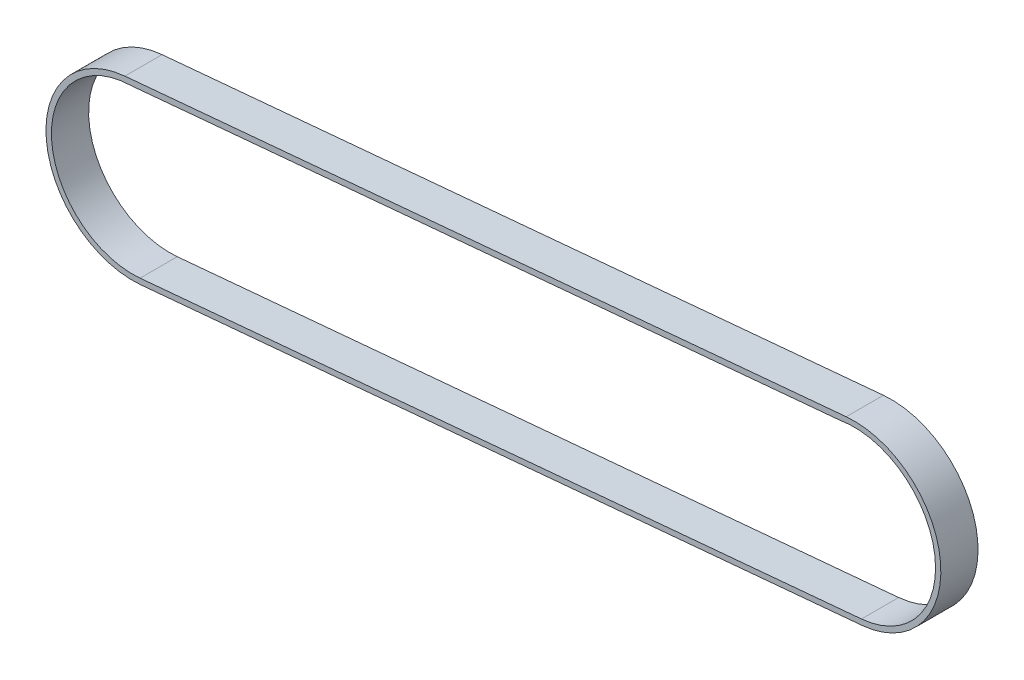
ISO-10303-21;
HEADER;
FILE_DESCRIPTION(('STEP AP214'),'2;1');
FILE_NAME('part.step','',(''),(''),'','','');
FILE_SCHEMA(('AUTOMOTIVE_DESIGN { 1 0 10303 214 1 1 1 1 }'));
ENDSEC;
DATA;
#1=APPLICATION_CONTEXT('core data for automotive mechanical design processes');
#2=APPLICATION_PROTOCOL_DEFINITION('international standard','automotive_design',2000,#1);
#3=PRODUCT_CONTEXT('',#1,'mechanical');
#4=PRODUCT('Part','Part','',(#3));
#5=PRODUCT_RELATED_PRODUCT_CATEGORY('part','',(#4));
#6=PRODUCT_DEFINITION_FORMATION('','',#4);
#7=PRODUCT_DEFINITION_CONTEXT('part definition',#1,'design');
#8=PRODUCT_DEFINITION('design','',#6,#7);
#9=PRODUCT_DEFINITION_SHAPE('','',#8);
#10=(LENGTH_UNIT() NAMED_UNIT(*) SI_UNIT(.MILLI.,.METRE.));
#11=(NAMED_UNIT(*) PLANE_ANGLE_UNIT() SI_UNIT($,.RADIAN.));
#12=(NAMED_UNIT(*) SI_UNIT($,.STERADIAN.) SOLID_ANGLE_UNIT());
#13=UNCERTAINTY_MEASURE_WITH_UNIT(LENGTH_MEASURE(1.E-05),#10,'distance_accuracy_value','');
#14=(GEOMETRIC_REPRESENTATION_CONTEXT(3) GLOBAL_UNCERTAINTY_ASSIGNED_CONTEXT((#13)) GLOBAL_UNIT_ASSIGNED_CONTEXT((#10,
#11,#12)) REPRESENTATION_CONTEXT('',''));
#15=CARTESIAN_POINT('',(0.,0.,0.));
#16=DIRECTION('',(0.,0.,1.));
#17=DIRECTION('',(1.,0.,0.));
#18=AXIS2_PLACEMENT_3D('',#15,#16,#17);
#19=CARTESIAN_POINT('',(-8.44642834172912,92.7513451865349,7.5));
#20=DIRECTION('',(0.0906900274029644,-0.995879168840101,0.));
#21=DIRECTION('',(0.995879168840101,0.0906900274029644,0.));
#22=AXIS2_PLACEMENT_3D('',#19,#20,#21);
#23=PLANE('',#22);
#24=DIRECTION('',(-0.995879168840101,-0.0906900274029644,0.));
#25=VECTOR('',#24,1.);
#26=CARTESIAN_POINT('',(-8.44642834172912,92.7513451865349,-7.5));
#27=LINE('',#26,#25);
#28=CARTESIAN_POINT('',(212.322925822602,112.855770909404,-7.5));
#29=VERTEX_POINT('',#28);
#30=CARTESIAN_POINT('',(-78.6770741773979,86.3557709094036,-7.5));
#31=VERTEX_POINT('',#30);
#32=EDGE_CURVE('E148',#29,#31,#27,.T.);
#33=ORIENTED_EDGE('',*,*,#32,.T.);
#34=DIRECTION('',(0.,0.,-1.));
#35=VECTOR('',#34,1.);
#36=CARTESIAN_POINT('',(-78.6770741773979,86.3557709094036,7.5));
#37=LINE('',#36,#35);
#38=CARTESIAN_POINT('',(-78.6770741773979,86.3557709094036,7.5));
#39=VERTEX_POINT('',#38);
#40=EDGE_CURVE('E11',#39,#31,#37,.T.);
#41=ORIENTED_EDGE('',*,*,#40,.F.);
#42=DIRECTION('',(-0.995879168840101,-0.0906900274029644,0.));
#43=VECTOR('',#42,1.);
#44=CARTESIAN_POINT('',(-8.44642834172912,92.7513451865349,7.5));
#45=LINE('',#44,#43);
#46=CARTESIAN_POINT('',(212.322925822602,112.855770909404,7.5));
#47=VERTEX_POINT('',#46);
#48=EDGE_CURVE('E119',#47,#39,#45,.T.);
#49=ORIENTED_EDGE('',*,*,#48,.F.);
#50=DIRECTION('',(0.,0.,-1.));
#51=VECTOR('',#50,1.);
#52=CARTESIAN_POINT('',(212.322925822602,112.855770909404,7.5));
#53=LINE('',#52,#51);
#54=EDGE_CURVE('E156',#47,#29,#53,.T.);
#55=ORIENTED_EDGE('',*,*,#54,.T.);
#56=EDGE_LOOP('',(#33,#41,#49,#55));
#57=FACE_BOUND('',#56,.T.);
#58=ADVANCED_FACE('F42',(#57),#23,.F.);
#59=CARTESIAN_POINT('',(-75.5029232182942,51.5,7.5));
#60=DIRECTION('',(0.,0.,-1.));
#61=DIRECTION('',(-1.,0.,0.));
#62=AXIS2_PLACEMENT_3D('',#59,#60,#61);
#63=CYLINDRICAL_SURFACE('',#62,35.);
#64=CARTESIAN_POINT('',(-75.5029232182942,51.5,-7.5));
#65=DIRECTION('',(0.,0.,1.));
#66=DIRECTION('',(1.,0.,0.));
#67=AXIS2_PLACEMENT_3D('',#64,#65,#66);
#68=CIRCLE('',#67,35.);
#69=CARTESIAN_POINT('',(-72.3287722591905,16.6442290905965,-7.5));
#70=VERTEX_POINT('',#69);
#71=EDGE_CURVE('E125',#31,#70,#68,.T.);
#72=ORIENTED_EDGE('',*,*,#71,.T.);
#73=DIRECTION('',(0.,0.,-1.));
#74=VECTOR('',#73,1.);
#75=CARTESIAN_POINT('',(-72.3287722591905,16.6442290905965,7.5));
#76=LINE('',#75,#74);
#77=CARTESIAN_POINT('',(-72.3287722591905,16.6442290905965,7.5));
#78=VERTEX_POINT('',#77);
#79=EDGE_CURVE('E52',#78,#70,#76,.T.);
#80=ORIENTED_EDGE('',*,*,#79,.F.);
#81=CARTESIAN_POINT('',(-75.5029232182942,51.5,7.5));
#82=DIRECTION('',(0.,0.,1.));
#83=DIRECTION('',(1.,0.,0.));
#84=AXIS2_PLACEMENT_3D('',#81,#82,#83);
#85=CIRCLE('',#84,35.);
#86=EDGE_CURVE('E113',#39,#78,#85,.T.);
#87=ORIENTED_EDGE('',*,*,#86,.F.);
#88=ORIENTED_EDGE('',*,*,#40,.T.);
#89=EDGE_LOOP('',(#72,#80,#87,#88));
#90=FACE_BOUND('',#89,.T.);
#91=ADVANCED_FACE('F124',(#90),#63,.T.);
#92=CARTESIAN_POINT('',(-2.0981264235216,23.0398033677279,7.5));
#93=DIRECTION('',(0.0906900274029643,-0.995879168840101,0.));
#94=DIRECTION('',(0.995879168840101,0.0906900274029643,0.));
#95=AXIS2_PLACEMENT_3D('',#92,#93,#94);
#96=PLANE('',#95);
#97=DIRECTION('',(-0.995879168840101,-0.0906900274029643,0.));
#98=VECTOR('',#97,1.);
#99=CARTESIAN_POINT('',(-2.0981264235216,23.0398033677279,-7.5));
#100=LINE('',#99,#98);
#101=CARTESIAN_POINT('',(218.67122774081,43.1442290905965,-7.5));
#102=VERTEX_POINT('',#101);
#103=EDGE_CURVE('E152',#102,#70,#100,.T.);
#104=ORIENTED_EDGE('',*,*,#103,.F.);
#105=DIRECTION('',(0.,0.,-1.));
#106=VECTOR('',#105,1.);
#107=CARTESIAN_POINT('',(218.67122774081,43.1442290905965,7.5));
#108=LINE('',#107,#106);
#109=CARTESIAN_POINT('',(218.67122774081,43.1442290905965,7.5));
#110=VERTEX_POINT('',#109);
#111=EDGE_CURVE('E89',#110,#102,#108,.T.);
#112=ORIENTED_EDGE('',*,*,#111,.F.);
#113=DIRECTION('',(-0.995879168840101,-0.0906900274029643,0.));
#114=VECTOR('',#113,1.);
#115=CARTESIAN_POINT('',(-2.0981264235216,23.0398033677279,7.5));
#116=LINE('',#115,#114);
#117=EDGE_CURVE('E117',#110,#78,#116,.T.);
#118=ORIENTED_EDGE('',*,*,#117,.T.);
#119=ORIENTED_EDGE('',*,*,#79,.T.);
#120=EDGE_LOOP('',(#104,#112,#118,#119));
#121=FACE_BOUND('',#120,.T.);
#122=ADVANCED_FACE('F130',(#121),#96,.T.);
#123=CARTESIAN_POINT('',(-75.5029232182942,51.5,7.5));
#124=DIRECTION('',(0.,0.,-1.));
#125=DIRECTION('',(-1.,0.,0.));
#126=AXIS2_PLACEMENT_3D('',#123,#124,#125);
#127=CYLINDRICAL_SURFACE('',#126,32.7983025223947);
#128=CARTESIAN_POINT('',(-75.5029232182942,51.5,-7.5));
#129=DIRECTION('',(0.,0.,1.));
#130=DIRECTION('',(1.,0.,0.));
#131=AXIS2_PLACEMENT_3D('',#128,#129,#130);
#132=CIRCLE('',#131,32.7983025223947);
#133=CARTESIAN_POINT('',(-76.1680678689313,84.2915573119706,-7.5));
#134=VERTEX_POINT('',#133);
#135=CARTESIAN_POINT('',(-72.535281972323,18.8362317883296,-7.5));
#136=VERTEX_POINT('',#135);
#137=EDGE_CURVE('E136',#134,#136,#132,.T.);
#138=ORIENTED_EDGE('',*,*,#137,.F.);
#139=DIRECTION('',(0.,0.,-1.));
#140=VECTOR('',#139,1.);
#141=CARTESIAN_POINT('',(-76.1680678689313,84.2915573119706,7.5));
#142=LINE('',#141,#140);
#143=CARTESIAN_POINT('',(-76.1680678689313,84.2915573119706,7.5));
#144=VERTEX_POINT('',#143);
#145=EDGE_CURVE('E46',#144,#134,#142,.T.);
#146=ORIENTED_EDGE('',*,*,#145,.F.);
#147=CARTESIAN_POINT('',(-75.5029232182942,51.5,7.5));
#148=DIRECTION('',(0.,0.,1.));
#149=DIRECTION('',(1.,0.,0.));
#150=AXIS2_PLACEMENT_3D('',#147,#148,#149);
#151=CIRCLE('',#150,32.7983025223947);
#152=CARTESIAN_POINT('',(-72.535281972323,18.8362317883296,7.5));
#153=VERTEX_POINT('',#152);
#154=EDGE_CURVE('E155',#144,#153,#151,.T.);
#155=ORIENTED_EDGE('',*,*,#154,.T.);
#156=DIRECTION('',(0.,0.,-1.));
#157=VECTOR('',#156,1.);
#158=CARTESIAN_POINT('',(-72.535281972323,18.8362317883296,7.5));
#159=LINE('',#158,#157);
#160=EDGE_CURVE('E132',#153,#136,#159,.T.);
#161=ORIENTED_EDGE('',*,*,#160,.T.);
#162=EDGE_LOOP('',(#138,#146,#155,#161));
#163=FACE_BOUND('',#162,.T.);
#164=ADVANCED_FACE('F44',(#163),#127,.F.);
#165=CARTESIAN_POINT('',(-8.24917168390729,90.4835619495026,7.5));
#166=DIRECTION('',(0.0907911016346949,-0.995869959313945,0.));
#167=DIRECTION('',(0.995869959313945,0.0907911016346949,0.));
#168=AXIS2_PLACEMENT_3D('',#165,#166,#167);
#169=PLANE('',#168);
#170=DIRECTION('',(-0.995869959313945,-0.0907911016346949,0.));
#171=VECTOR('',#170,1.);
#172=CARTESIAN_POINT('',(-8.24917168390729,90.4835619495026,-7.5));
#173=LINE('',#172,#171);
#174=CARTESIAN_POINT('',(209.808909500006,110.363399900106,-7.5));
#175=VERTEX_POINT('',#174);
#176=EDGE_CURVE('E139',#175,#134,#173,.T.);
#177=ORIENTED_EDGE('',*,*,#176,.F.);
#178=DIRECTION('',(0.,0.,-1.));
#179=VECTOR('',#178,1.);
#180=CARTESIAN_POINT('',(209.808909500006,110.363399900106,7.5));
#181=LINE('',#180,#179);
#182=CARTESIAN_POINT('',(209.808909500006,110.363399900106,7.5));
#183=VERTEX_POINT('',#182);
#184=EDGE_CURVE('E161',#183,#175,#181,.T.);
#185=ORIENTED_EDGE('',*,*,#184,.F.);
#186=DIRECTION('',(-0.995869959313945,-0.0907911016346949,0.));
#187=VECTOR('',#186,1.);
#188=CARTESIAN_POINT('',(-8.24917168390729,90.4835619495026,7.5));
#189=LINE('',#188,#187);
#190=EDGE_CURVE('E170',#183,#144,#189,.T.);
#191=ORIENTED_EDGE('',*,*,#190,.T.);
#192=ORIENTED_EDGE('',*,*,#145,.T.);
#193=EDGE_LOOP('',(#177,#185,#191,#192));
#194=FACE_BOUND('',#193,.T.);
#195=ADVANCED_FACE('F168',(#194),#169,.T.);
#196=CARTESIAN_POINT('',(215.497076781706,78.,7.5));
#197=DIRECTION('',(0.,0.,-1.));
#198=DIRECTION('',(-1.,0.,0.));
#199=AXIS2_PLACEMENT_3D('',#196,#197,#198);
#200=CYLINDRICAL_SURFACE('',#199,32.859472);
#201=CARTESIAN_POINT('',(215.497076781706,78.,-7.5));
#202=DIRECTION('',(0.,0.,1.));
#203=DIRECTION('',(1.,0.,0.));
#204=AXIS2_PLACEMENT_3D('',#201,#202,#203);
#205=CIRCLE('',#204,32.859472);
#206=CARTESIAN_POINT('',(218.470252736817,45.2753132198529,-7.5));
#207=VERTEX_POINT('',#206);
#208=EDGE_CURVE('E142',#207,#175,#205,.T.);
#209=ORIENTED_EDGE('',*,*,#208,.F.);
#210=DIRECTION('',(0.,0.,-1.));
#211=VECTOR('',#210,1.);
#212=CARTESIAN_POINT('',(218.470252736817,45.2753132198529,7.5));
#213=LINE('',#212,#211);
#214=CARTESIAN_POINT('',(218.470252736817,45.2753132198529,7.5));
#215=VERTEX_POINT('',#214);
#216=EDGE_CURVE('E160',#215,#207,#213,.T.);
#217=ORIENTED_EDGE('',*,*,#216,.F.);
#218=CARTESIAN_POINT('',(215.497076781706,78.,7.5));
#219=DIRECTION('',(0.,0.,1.));
#220=DIRECTION('',(1.,0.,0.));
#221=AXIS2_PLACEMENT_3D('',#218,#219,#220);
#222=CIRCLE('',#221,32.859472);
#223=EDGE_CURVE('E179',#215,#183,#222,.T.);
#224=ORIENTED_EDGE('',*,*,#223,.T.);
#225=ORIENTED_EDGE('',*,*,#184,.T.);
#226=EDGE_LOOP('',(#209,#217,#224,#225));
#227=FACE_BOUND('',#226,.T.);
#228=ADVANCED_FACE('F176',(#227),#200,.F.);
#229=CARTESIAN_POINT('',(-2.29118039196859,25.2182049821502,7.5));
#230=DIRECTION('',(0.0904815498895082,-0.995898131903857,0.));
#231=DIRECTION('',(0.995898131903857,0.0904815498895082,0.));
#232=AXIS2_PLACEMENT_3D('',#229,#230,#231);
#233=PLANE('',#232);
#234=DIRECTION('',(-0.995898131903857,-0.0904815498895082,0.));
#235=VECTOR('',#234,1.);
#236=CARTESIAN_POINT('',(-2.29118039196859,25.2182049821502,-7.5));
#237=LINE('',#236,#235);
#238=EDGE_CURVE('E145',#207,#136,#237,.T.);
#239=ORIENTED_EDGE('',*,*,#238,.T.);
#240=ORIENTED_EDGE('',*,*,#160,.F.);
#241=DIRECTION('',(-0.995898131903857,-0.0904815498895082,0.));
#242=VECTOR('',#241,1.);
#243=CARTESIAN_POINT('',(-2.29118039196859,25.2182049821502,7.5));
#244=LINE('',#243,#242);
#245=EDGE_CURVE('E181',#215,#153,#244,.T.);
#246=ORIENTED_EDGE('',*,*,#245,.F.);
#247=ORIENTED_EDGE('',*,*,#216,.T.);
#248=EDGE_LOOP('',(#239,#240,#246,#247));
#249=FACE_BOUND('',#248,.T.);
#250=ADVANCED_FACE('F182',(#249),#233,.F.);
#251=CARTESIAN_POINT('',(215.497076781706,78.,7.5));
#252=DIRECTION('',(0.,0.,-1.));
#253=DIRECTION('',(-1.,0.,0.));
#254=AXIS2_PLACEMENT_3D('',#251,#252,#253);
#255=CYLINDRICAL_SURFACE('',#254,35.);
#256=CARTESIAN_POINT('',(215.497076781706,78.,-7.5));
#257=DIRECTION('',(0.,0.,1.));
#258=DIRECTION('',(1.,0.,0.));
#259=AXIS2_PLACEMENT_3D('',#256,#257,#258);
#260=CIRCLE('',#259,35.);
#261=EDGE_CURVE('E92',#102,#29,#260,.T.);
#262=ORIENTED_EDGE('',*,*,#261,.T.);
#263=ORIENTED_EDGE('',*,*,#54,.F.);
#264=CARTESIAN_POINT('',(215.497076781706,78.,7.5));
#265=DIRECTION('',(0.,0.,1.));
#266=DIRECTION('',(1.,0.,0.));
#267=AXIS2_PLACEMENT_3D('',#264,#265,#266);
#268=CIRCLE('',#267,35.);
#269=EDGE_CURVE('E61',#110,#47,#268,.T.);
#270=ORIENTED_EDGE('',*,*,#269,.F.);
#271=ORIENTED_EDGE('',*,*,#111,.T.);
#272=EDGE_LOOP('',(#262,#263,#270,#271));
#273=FACE_BOUND('',#272,.T.);
#274=ADVANCED_FACE('F189',(#273),#255,.T.);
#275=CARTESIAN_POINT('',(0.,0.,7.5));
#276=DIRECTION('',(0.,0.,1.));
#277=DIRECTION('',(1.,0.,0.));
#278=AXIS2_PLACEMENT_3D('',#275,#276,#277);
#279=PLANE('',#278);
#280=ORIENTED_EDGE('',*,*,#154,.F.);
#281=ORIENTED_EDGE('',*,*,#190,.F.);
#282=ORIENTED_EDGE('',*,*,#223,.F.);
#283=ORIENTED_EDGE('',*,*,#245,.T.);
#284=EDGE_LOOP('',(#280,#281,#282,#283));
#285=FACE_BOUND('',#284,.T.);
#286=ORIENTED_EDGE('',*,*,#48,.T.);
#287=ORIENTED_EDGE('',*,*,#86,.T.);
#288=ORIENTED_EDGE('',*,*,#117,.F.);
#289=ORIENTED_EDGE('',*,*,#269,.T.);
#290=EDGE_LOOP('',(#286,#287,#288,#289));
#291=FACE_BOUND('',#290,.T.);
#292=ADVANCED_FACE('F115',(#285,#291),#279,.T.);
#293=CARTESIAN_POINT('',(0.,0.,-7.5));
#294=DIRECTION('',(0.,0.,1.));
#295=DIRECTION('',(1.,0.,0.));
#296=AXIS2_PLACEMENT_3D('',#293,#294,#295);
#297=PLANE('',#296);
#298=ORIENTED_EDGE('',*,*,#137,.T.);
#299=ORIENTED_EDGE('',*,*,#238,.F.);
#300=ORIENTED_EDGE('',*,*,#208,.T.);
#301=ORIENTED_EDGE('',*,*,#176,.T.);
#302=EDGE_LOOP('',(#298,#299,#300,#301));
#303=FACE_BOUND('',#302,.T.);
#304=ORIENTED_EDGE('',*,*,#32,.F.);
#305=ORIENTED_EDGE('',*,*,#261,.F.);
#306=ORIENTED_EDGE('',*,*,#103,.T.);
#307=ORIENTED_EDGE('',*,*,#71,.F.);
#308=EDGE_LOOP('',(#304,#305,#306,#307));
#309=FACE_BOUND('',#308,.T.);
#310=ADVANCED_FACE('F174',(#303,#309),#297,.F.);
#311=CLOSED_SHELL('',(#58,#91,#122,#164,#195,#228,#250,#274,#292,#310));
#312=MANIFOLD_SOLID_BREP('B2',#311);
#313=ADVANCED_BREP_SHAPE_REPRESENTATION('',(#18,#312),#14);
#314=SHAPE_DEFINITION_REPRESENTATION(#9,#313);
ENDSEC;
END-ISO-10303-21;
